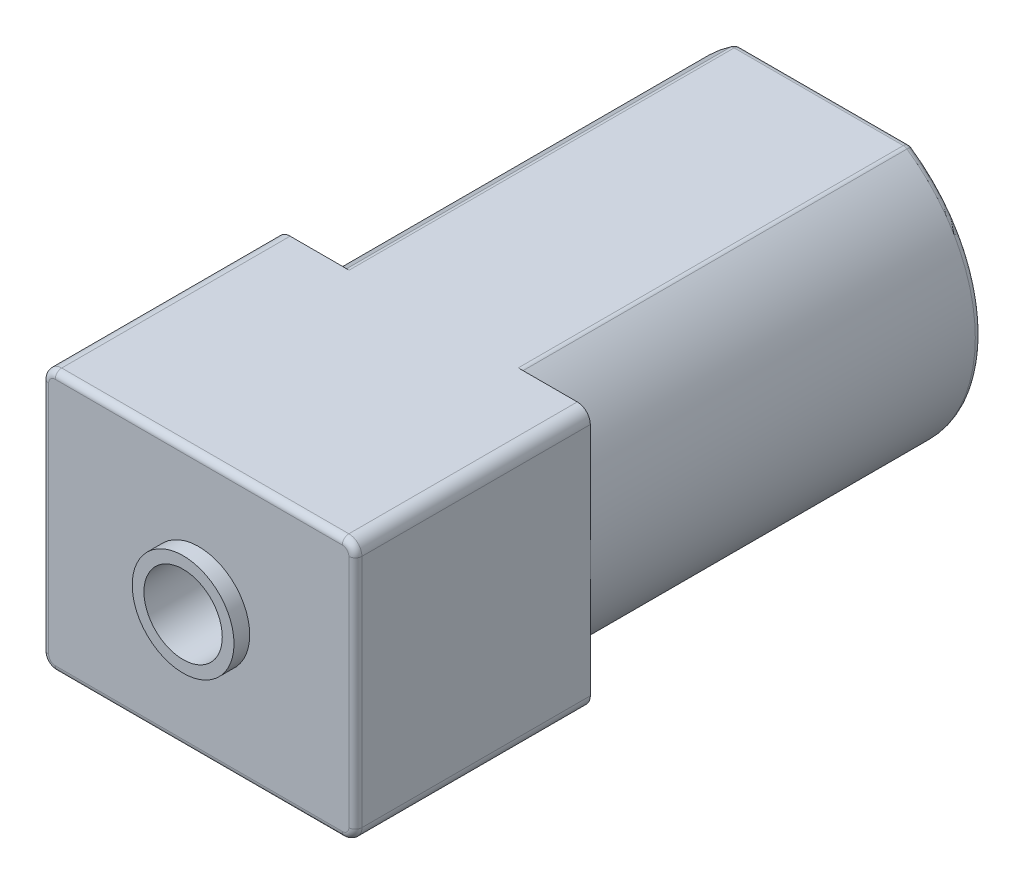
ISO-10303-21;
HEADER;
FILE_DESCRIPTION(('STEP AP214'),'2;1');
FILE_NAME('part.step','',(''),(''),'','','');
FILE_SCHEMA(('AUTOMOTIVE_DESIGN { 1 0 10303 214 1 1 1 1 }'));
ENDSEC;
DATA;
#1=APPLICATION_CONTEXT('core data for automotive mechanical design processes');
#2=APPLICATION_PROTOCOL_DEFINITION('international standard','automotive_design',2000,#1);
#3=PRODUCT_CONTEXT('',#1,'mechanical');
#4=PRODUCT('Part','Part','',(#3));
#5=PRODUCT_RELATED_PRODUCT_CATEGORY('part','',(#4));
#6=PRODUCT_DEFINITION_FORMATION('','',#4);
#7=PRODUCT_DEFINITION_CONTEXT('part definition',#1,'design');
#8=PRODUCT_DEFINITION('design','',#6,#7);
#9=PRODUCT_DEFINITION_SHAPE('','',#8);
#10=(LENGTH_UNIT() NAMED_UNIT(*) SI_UNIT(.MILLI.,.METRE.));
#11=(NAMED_UNIT(*) PLANE_ANGLE_UNIT() SI_UNIT($,.RADIAN.));
#12=(NAMED_UNIT(*) SI_UNIT($,.STERADIAN.) SOLID_ANGLE_UNIT());
#13=UNCERTAINTY_MEASURE_WITH_UNIT(LENGTH_MEASURE(1.E-05),#10,'distance_accuracy_value','');
#14=(GEOMETRIC_REPRESENTATION_CONTEXT(3) GLOBAL_UNCERTAINTY_ASSIGNED_CONTEXT((#13)) GLOBAL_UNIT_ASSIGNED_CONTEXT((#10,
#11,#12)) REPRESENTATION_CONTEXT('',''));
#15=CARTESIAN_POINT('',(0.,0.,0.));
#16=DIRECTION('',(0.,0.,1.));
#17=DIRECTION('',(1.,0.,0.));
#18=AXIS2_PLACEMENT_3D('',#15,#16,#17);
#19=CARTESIAN_POINT('',(-6.,-5.,24.));
#20=DIRECTION('',(0.,0.,1.));
#21=DIRECTION('',(1.,0.,0.));
#22=AXIS2_PLACEMENT_3D('',#19,#20,#21);
#23=PLANE('',#22);
#24=DIRECTION('',(0.,1.,0.));
#25=VECTOR('',#24,1.);
#26=CARTESIAN_POINT('',(5.75,4.5,24.));
#27=LINE('',#26,#25);
#28=CARTESIAN_POINT('',(5.75,-4.5,24.));
#29=VERTEX_POINT('',#28);
#30=CARTESIAN_POINT('',(5.75,4.5,24.));
#31=VERTEX_POINT('',#30);
#32=EDGE_CURVE('E277',#29,#31,#27,.T.);
#33=ORIENTED_EDGE('',*,*,#32,.T.);
#34=CARTESIAN_POINT('',(5.5,4.5,24.));
#35=DIRECTION('',(0.,0.,1.));
#36=DIRECTION('',(1.,0.,0.));
#37=AXIS2_PLACEMENT_3D('',#34,#35,#36);
#38=CIRCLE('',#37,0.25);
#39=CARTESIAN_POINT('',(5.5,4.75,24.));
#40=VERTEX_POINT('',#39);
#41=EDGE_CURVE('E279',#31,#40,#38,.T.);
#42=ORIENTED_EDGE('',*,*,#41,.T.);
#43=DIRECTION('',(-1.,0.,0.));
#44=VECTOR('',#43,1.);
#45=CARTESIAN_POINT('',(-6.,4.75,24.));
#46=LINE('',#45,#44);
#47=CARTESIAN_POINT('',(-5.5,4.75,24.));
#48=VERTEX_POINT('',#47);
#49=EDGE_CURVE('E265',#40,#48,#46,.T.);
#50=ORIENTED_EDGE('',*,*,#49,.T.);
#51=CARTESIAN_POINT('',(-5.5,4.5,24.));
#52=DIRECTION('',(0.,0.,1.));
#53=DIRECTION('',(1.,0.,0.));
#54=AXIS2_PLACEMENT_3D('',#51,#52,#53);
#55=CIRCLE('',#54,0.25);
#56=CARTESIAN_POINT('',(-5.75,4.5,24.));
#57=VERTEX_POINT('',#56);
#58=EDGE_CURVE('E267',#48,#57,#55,.T.);
#59=ORIENTED_EDGE('',*,*,#58,.T.);
#60=DIRECTION('',(0.,-1.,0.));
#61=VECTOR('',#60,1.);
#62=CARTESIAN_POINT('',(-5.75,-4.5,24.));
#63=LINE('',#62,#61);
#64=CARTESIAN_POINT('',(-5.75,-4.5,24.));
#65=VERTEX_POINT('',#64);
#66=EDGE_CURVE('E269',#57,#65,#63,.T.);
#67=ORIENTED_EDGE('',*,*,#66,.T.);
#68=CARTESIAN_POINT('',(-5.5,-4.5,24.));
#69=DIRECTION('',(0.,0.,1.));
#70=DIRECTION('',(1.,0.,0.));
#71=AXIS2_PLACEMENT_3D('',#68,#69,#70);
#72=CIRCLE('',#71,0.25);
#73=CARTESIAN_POINT('',(-5.5,-4.75,24.));
#74=VERTEX_POINT('',#73);
#75=EDGE_CURVE('E271',#65,#74,#72,.T.);
#76=ORIENTED_EDGE('',*,*,#75,.T.);
#77=DIRECTION('',(1.,0.,0.));
#78=VECTOR('',#77,1.);
#79=CARTESIAN_POINT('',(-6.,-4.75,24.));
#80=LINE('',#79,#78);
#81=CARTESIAN_POINT('',(5.5,-4.75,24.));
#82=VERTEX_POINT('',#81);
#83=EDGE_CURVE('E273',#74,#82,#80,.T.);
#84=ORIENTED_EDGE('',*,*,#83,.T.);
#85=CARTESIAN_POINT('',(5.5,-4.5,24.));
#86=DIRECTION('',(0.,0.,1.));
#87=DIRECTION('',(1.,0.,0.));
#88=AXIS2_PLACEMENT_3D('',#85,#86,#87);
#89=CIRCLE('',#88,0.25);
#90=EDGE_CURVE('E275',#82,#29,#89,.T.);
#91=ORIENTED_EDGE('',*,*,#90,.T.);
#92=EDGE_LOOP('',(#33,#42,#50,#59,#67,#76,#84,#91));
#93=FACE_BOUND('',#92,.T.);
#94=CARTESIAN_POINT('',(0.,0.,24.));
#95=DIRECTION('',(0.,0.,1.));
#96=DIRECTION('',(1.,0.,0.));
#97=AXIS2_PLACEMENT_3D('',#94,#95,#96);
#98=CIRCLE('',#97,1.95);
#99=CARTESIAN_POINT('',(1.95,0.,24.));
#100=VERTEX_POINT('',#99);
#101=EDGE_CURVE('E476',#100,#100,#98,.T.);
#102=ORIENTED_EDGE('',*,*,#101,.F.);
#103=EDGE_LOOP('',(#102));
#104=FACE_BOUND('',#103,.T.);
#105=ADVANCED_FACE('F35',(#93,#104),#23,.T.);
#106=CARTESIAN_POINT('',(0.,0.,0.));
#107=DIRECTION('',(0.,0.,1.));
#108=DIRECTION('',(1.,0.,0.));
#109=AXIS2_PLACEMENT_3D('',#106,#107,#108);
#110=PLANE('',#109);
#111=CARTESIAN_POINT('',(0.,0.,0.));
#112=DIRECTION('',(0.,0.,1.));
#113=DIRECTION('',(1.,0.,0.));
#114=AXIS2_PLACEMENT_3D('',#111,#112,#113);
#115=CIRCLE('',#114,2.75);
#116=CARTESIAN_POINT('',(2.75,0.,0.));
#117=VERTEX_POINT('',#116);
#118=EDGE_CURVE('E340',#117,#117,#115,.T.);
#119=ORIENTED_EDGE('',*,*,#118,.T.);
#120=EDGE_LOOP('',(#119));
#121=FACE_BOUND('',#120,.T.);
#122=CARTESIAN_POINT('',(0.,0.,0.));
#123=DIRECTION('',(0.,0.,1.));
#124=DIRECTION('',(1.,0.,0.));
#125=AXIS2_PLACEMENT_3D('',#122,#123,#124);
#126=CIRCLE('',#125,5.75);
#127=CARTESIAN_POINT('',(3.24037034920393,4.75,0.));
#128=VERTEX_POINT('',#127);
#129=CARTESIAN_POINT('',(3.24037034920393,-4.75,0.));
#130=VERTEX_POINT('',#129);
#131=EDGE_CURVE('E335',#128,#130,#126,.F.);
#132=ORIENTED_EDGE('',*,*,#131,.T.);
#133=DIRECTION('',(1.,0.,0.));
#134=VECTOR('',#133,1.);
#135=CARTESIAN_POINT('',(-3.3166247903554,-4.75,0.));
#136=LINE('',#135,#134);
#137=CARTESIAN_POINT('',(-3.24037034920393,-4.75,0.));
#138=VERTEX_POINT('',#137);
#139=EDGE_CURVE('E338',#130,#138,#136,.F.);
#140=ORIENTED_EDGE('',*,*,#139,.T.);
#141=CARTESIAN_POINT('',(0.,0.,0.));
#142=DIRECTION('',(0.,0.,1.));
#143=DIRECTION('',(1.,0.,0.));
#144=AXIS2_PLACEMENT_3D('',#141,#142,#143);
#145=CIRCLE('',#144,5.75);
#146=CARTESIAN_POINT('',(-3.24037034920393,4.75,0.));
#147=VERTEX_POINT('',#146);
#148=EDGE_CURVE('E333',#138,#147,#145,.F.);
#149=ORIENTED_EDGE('',*,*,#148,.T.);
#150=DIRECTION('',(-1.,0.,0.));
#151=VECTOR('',#150,1.);
#152=CARTESIAN_POINT('',(3.3166247903554,4.75,0.));
#153=LINE('',#152,#151);
#154=EDGE_CURVE('E331',#147,#128,#153,.F.);
#155=ORIENTED_EDGE('',*,*,#154,.T.);
#156=EDGE_LOOP('',(#132,#140,#149,#155));
#157=FACE_BOUND('',#156,.T.);
#158=ADVANCED_FACE('F440',(#121,#157),#110,.F.);
#159=CARTESIAN_POINT('',(0.,0.,15.));
#160=DIRECTION('',(0.,0.,-1.));
#161=DIRECTION('',(-1.,0.,0.));
#162=AXIS2_PLACEMENT_3D('',#159,#160,#161);
#163=CYLINDRICAL_SURFACE('',#162,6.);
#164=CARTESIAN_POINT('',(0.,0.,0.25));
#165=DIRECTION('',(0.,0.,1.));
#166=DIRECTION('',(1.,0.,0.));
#167=AXIS2_PLACEMENT_3D('',#164,#165,#166);
#168=CIRCLE('',#167,6.);
#169=CARTESIAN_POINT('',(-3.38125601656063,4.95652173913043,0.25));
#170=VERTEX_POINT('',#169);
#171=CARTESIAN_POINT('',(-3.38125601656062,-4.95652173913043,0.25));
#172=VERTEX_POINT('',#171);
#173=EDGE_CURVE('E360',#170,#172,#168,.T.);
#174=ORIENTED_EDGE('',*,*,#173,.T.);
#175=DIRECTION('',(0.,0.,-1.));
#176=VECTOR('',#175,1.);
#177=CARTESIAN_POINT('',(-3.38125601656062,-4.95652173913044,15.));
#178=LINE('',#177,#176);
#179=CARTESIAN_POINT('',(-3.38125601656062,-4.95652173913043,15.));
#180=VERTEX_POINT('',#179);
#181=EDGE_CURVE('E364',#172,#180,#178,.F.);
#182=ORIENTED_EDGE('',*,*,#181,.T.);
#183=CARTESIAN_POINT('',(0.,0.,15.));
#184=DIRECTION('',(0.,0.,1.));
#185=DIRECTION('',(1.,0.,0.));
#186=AXIS2_PLACEMENT_3D('',#183,#184,#185);
#187=CIRCLE('',#186,6.);
#188=CARTESIAN_POINT('',(-6.,0.,15.));
#189=VERTEX_POINT('',#188);
#190=EDGE_CURVE('E238',#189,#180,#187,.T.);
#191=ORIENTED_EDGE('',*,*,#190,.F.);
#192=CARTESIAN_POINT('',(-3.38125601656063,4.95652173913043,15.));
#193=VERTEX_POINT('',#192);
#194=EDGE_CURVE('E220',#193,#189,#187,.T.);
#195=ORIENTED_EDGE('',*,*,#194,.F.);
#196=DIRECTION('',(0.,0.,-1.));
#197=VECTOR('',#196,1.);
#198=CARTESIAN_POINT('',(-3.38125601656063,4.95652173913043,15.));
#199=LINE('',#198,#197);
#200=EDGE_CURVE('E362',#193,#170,#199,.T.);
#201=ORIENTED_EDGE('',*,*,#200,.T.);
#202=EDGE_LOOP('',(#174,#182,#191,#195,#201));
#203=FACE_BOUND('',#202,.T.);
#204=ADVANCED_FACE('F447',(#203),#163,.T.);
#205=CARTESIAN_POINT('',(3.38125601656063,-4.95652173913043,15.));
#206=VERTEX_POINT('',#205);
#207=CARTESIAN_POINT('',(6.,0.,15.));
#208=VERTEX_POINT('',#207);
#209=EDGE_CURVE('E191',#206,#208,#187,.T.);
#210=ORIENTED_EDGE('',*,*,#209,.F.);
#211=DIRECTION('',(0.,0.,-1.));
#212=VECTOR('',#211,1.);
#213=CARTESIAN_POINT('',(3.38125601656063,-4.95652173913043,15.));
#214=LINE('',#213,#212);
#215=CARTESIAN_POINT('',(3.38125601656063,-4.95652173913043,0.25));
#216=VERTEX_POINT('',#215);
#217=EDGE_CURVE('E359',#206,#216,#214,.T.);
#218=ORIENTED_EDGE('',*,*,#217,.T.);
#219=CARTESIAN_POINT('',(0.,0.,0.25));
#220=DIRECTION('',(0.,0.,1.));
#221=DIRECTION('',(1.,0.,0.));
#222=AXIS2_PLACEMENT_3D('',#219,#220,#221);
#223=CIRCLE('',#222,6.);
#224=CARTESIAN_POINT('',(3.38125601656063,4.95652173913043,0.25));
#225=VERTEX_POINT('',#224);
#226=EDGE_CURVE('E349',#216,#225,#223,.T.);
#227=ORIENTED_EDGE('',*,*,#226,.T.);
#228=DIRECTION('',(0.,0.,-1.));
#229=VECTOR('',#228,1.);
#230=CARTESIAN_POINT('',(3.38125601656063,4.95652173913043,15.));
#231=LINE('',#230,#229);
#232=CARTESIAN_POINT('',(3.38125601656063,4.95652173913043,15.));
#233=VERTEX_POINT('',#232);
#234=EDGE_CURVE('E217',#225,#233,#231,.F.);
#235=ORIENTED_EDGE('',*,*,#234,.T.);
#236=EDGE_CURVE('E201',#208,#233,#187,.T.);
#237=ORIENTED_EDGE('',*,*,#236,.F.);
#238=EDGE_LOOP('',(#210,#218,#227,#235,#237));
#239=FACE_BOUND('',#238,.T.);
#240=ADVANCED_FACE('F215',(#239),#163,.T.);
#241=CARTESIAN_POINT('',(-6.,-5.,0.));
#242=DIRECTION('',(0.,-1.,0.));
#243=DIRECTION('',(1.,0.,0.));
#244=AXIS2_PLACEMENT_3D('',#241,#242,#243);
#245=PLANE('',#244);
#246=DIRECTION('',(0.,0.,1.));
#247=VECTOR('',#246,1.);
#248=CARTESIAN_POINT('',(3.24037034920393,-5.,15.));
#249=LINE('',#248,#247);
#250=CARTESIAN_POINT('',(3.24037034920393,-5.,0.25));
#251=VERTEX_POINT('',#250);
#252=CARTESIAN_POINT('',(3.24037034920393,-5.,15.));
#253=VERTEX_POINT('',#252);
#254=EDGE_CURVE('E347',#251,#253,#249,.T.);
#255=ORIENTED_EDGE('',*,*,#254,.T.);
#256=DIRECTION('',(1.,0.,0.));
#257=VECTOR('',#256,1.);
#258=CARTESIAN_POINT('',(-6.,-5.,15.));
#259=LINE('',#258,#257);
#260=CARTESIAN_POINT('',(5.5,-5.,15.));
#261=VERTEX_POINT('',#260);
#262=EDGE_CURVE('E226',#253,#261,#259,.T.);
#263=ORIENTED_EDGE('',*,*,#262,.T.);
#264=DIRECTION('',(0.,0.,-1.));
#265=VECTOR('',#264,1.);
#266=CARTESIAN_POINT('',(5.5,-5.,24.));
#267=LINE('',#266,#265);
#268=CARTESIAN_POINT('',(5.5,-5.,23.75));
#269=VERTEX_POINT('',#268);
#270=EDGE_CURVE('E255',#261,#269,#267,.F.);
#271=ORIENTED_EDGE('',*,*,#270,.T.);
#272=DIRECTION('',(1.,0.,0.));
#273=VECTOR('',#272,1.);
#274=CARTESIAN_POINT('',(-6.,-5.,23.75));
#275=LINE('',#274,#273);
#276=CARTESIAN_POINT('',(-5.5,-5.,23.75));
#277=VERTEX_POINT('',#276);
#278=EDGE_CURVE('E289',#269,#277,#275,.F.);
#279=ORIENTED_EDGE('',*,*,#278,.T.);
#280=DIRECTION('',(0.,0.,-1.));
#281=VECTOR('',#280,1.);
#282=CARTESIAN_POINT('',(-5.5,-5.,15.));
#283=LINE('',#282,#281);
#284=CARTESIAN_POINT('',(-5.5,-5.,15.));
#285=VERTEX_POINT('',#284);
#286=EDGE_CURVE('E259',#277,#285,#283,.T.);
#287=ORIENTED_EDGE('',*,*,#286,.T.);
#288=CARTESIAN_POINT('',(-3.24037034920393,-5.,15.));
#289=VERTEX_POINT('',#288);
#290=EDGE_CURVE('E225',#285,#289,#259,.T.);
#291=ORIENTED_EDGE('',*,*,#290,.T.);
#292=DIRECTION('',(0.,0.,1.));
#293=VECTOR('',#292,1.);
#294=CARTESIAN_POINT('',(-3.24037034920393,-5.,0.));
#295=LINE('',#294,#293);
#296=CARTESIAN_POINT('',(-3.24037034920393,-5.,0.25));
#297=VERTEX_POINT('',#296);
#298=EDGE_CURVE('E345',#289,#297,#295,.F.);
#299=ORIENTED_EDGE('',*,*,#298,.T.);
#300=DIRECTION('',(1.,0.,0.));
#301=VECTOR('',#300,1.);
#302=CARTESIAN_POINT('',(3.3166247903554,-5.,0.25));
#303=LINE('',#302,#301);
#304=EDGE_CURVE('E343',#297,#251,#303,.T.);
#305=ORIENTED_EDGE('',*,*,#304,.T.);
#306=EDGE_LOOP('',(#255,#263,#271,#279,#287,#291,#299,#305));
#307=FACE_BOUND('',#306,.T.);
#308=ADVANCED_FACE('F524',(#307),#245,.T.);
#309=CARTESIAN_POINT('',(-6.,5.,0.));
#310=DIRECTION('',(0.,1.,0.));
#311=DIRECTION('',(-1.,0.,0.));
#312=AXIS2_PLACEMENT_3D('',#309,#310,#311);
#313=PLANE('',#312);
#314=DIRECTION('',(0.,0.,1.));
#315=VECTOR('',#314,1.);
#316=CARTESIAN_POINT('',(-3.24037034920393,5.,15.));
#317=LINE('',#316,#315);
#318=CARTESIAN_POINT('',(-3.24037034920393,5.,0.25));
#319=VERTEX_POINT('',#318);
#320=CARTESIAN_POINT('',(-3.24037034920393,5.,15.));
#321=VERTEX_POINT('',#320);
#322=EDGE_CURVE('E370',#319,#321,#317,.T.);
#323=ORIENTED_EDGE('',*,*,#322,.T.);
#324=DIRECTION('',(-1.,0.,0.));
#325=VECTOR('',#324,1.);
#326=CARTESIAN_POINT('',(-6.,5.,15.));
#327=LINE('',#326,#325);
#328=CARTESIAN_POINT('',(-5.5,5.,15.));
#329=VERTEX_POINT('',#328);
#330=EDGE_CURVE('E52',#321,#329,#327,.T.);
#331=ORIENTED_EDGE('',*,*,#330,.T.);
#332=DIRECTION('',(0.,0.,-1.));
#333=VECTOR('',#332,1.);
#334=CARTESIAN_POINT('',(-5.5,5.,24.));
#335=LINE('',#334,#333);
#336=CARTESIAN_POINT('',(-5.5,5.,23.75));
#337=VERTEX_POINT('',#336);
#338=EDGE_CURVE('E200',#329,#337,#335,.F.);
#339=ORIENTED_EDGE('',*,*,#338,.T.);
#340=DIRECTION('',(-1.,0.,0.));
#341=VECTOR('',#340,1.);
#342=CARTESIAN_POINT('',(-6.,5.,23.75));
#343=LINE('',#342,#341);
#344=CARTESIAN_POINT('',(5.5,5.,23.75));
#345=VERTEX_POINT('',#344);
#346=EDGE_CURVE('E297',#337,#345,#343,.F.);
#347=ORIENTED_EDGE('',*,*,#346,.T.);
#348=DIRECTION('',(0.,0.,-1.));
#349=VECTOR('',#348,1.);
#350=CARTESIAN_POINT('',(5.5,5.,15.));
#351=LINE('',#350,#349);
#352=CARTESIAN_POINT('',(5.5,5.,15.));
#353=VERTEX_POINT('',#352);
#354=EDGE_CURVE('E243',#345,#353,#351,.T.);
#355=ORIENTED_EDGE('',*,*,#354,.T.);
#356=CARTESIAN_POINT('',(3.24037034920393,5.,15.));
#357=VERTEX_POINT('',#356);
#358=EDGE_CURVE('E60',#353,#357,#327,.T.);
#359=ORIENTED_EDGE('',*,*,#358,.T.);
#360=DIRECTION('',(0.,0.,1.));
#361=VECTOR('',#360,1.);
#362=CARTESIAN_POINT('',(3.24037034920393,5.,0.));
#363=LINE('',#362,#361);
#364=CARTESIAN_POINT('',(3.24037034920393,5.,0.25));
#365=VERTEX_POINT('',#364);
#366=EDGE_CURVE('E368',#357,#365,#363,.F.);
#367=ORIENTED_EDGE('',*,*,#366,.T.);
#368=DIRECTION('',(-1.,0.,0.));
#369=VECTOR('',#368,1.);
#370=CARTESIAN_POINT('',(-3.3166247903554,5.,0.25));
#371=LINE('',#370,#369);
#372=EDGE_CURVE('E366',#365,#319,#371,.T.);
#373=ORIENTED_EDGE('',*,*,#372,.T.);
#374=EDGE_LOOP('',(#323,#331,#339,#347,#355,#359,#367,#373));
#375=FACE_BOUND('',#374,.T.);
#376=ADVANCED_FACE('F422',(#375),#313,.T.);
#377=CARTESIAN_POINT('',(-6.,-5.,15.));
#378=DIRECTION('',(0.,0.,1.));
#379=DIRECTION('',(1.,0.,0.));
#380=AXIS2_PLACEMENT_3D('',#377,#378,#379);
#381=PLANE('',#380);
#382=DIRECTION('',(0.,1.,0.));
#383=VECTOR('',#382,1.);
#384=CARTESIAN_POINT('',(6.,5.,15.));
#385=LINE('',#384,#383);
#386=CARTESIAN_POINT('',(6.,-4.5,15.));
#387=VERTEX_POINT('',#386);
#388=EDGE_CURVE('E194',#387,#208,#385,.T.);
#389=ORIENTED_EDGE('',*,*,#388,.F.);
#390=CARTESIAN_POINT('',(5.5,-4.5,15.));
#391=DIRECTION('',(0.,0.,1.));
#392=DIRECTION('',(1.,0.,0.));
#393=AXIS2_PLACEMENT_3D('',#390,#391,#392);
#394=CIRCLE('',#393,0.5);
#395=EDGE_CURVE('E263',#387,#261,#394,.F.);
#396=ORIENTED_EDGE('',*,*,#395,.T.);
#397=ORIENTED_EDGE('',*,*,#262,.F.);
#398=CARTESIAN_POINT('',(3.24037034920393,-4.75,15.));
#399=DIRECTION('',(0.,0.,1.));
#400=DIRECTION('',(1.,0.,0.));
#401=AXIS2_PLACEMENT_3D('',#398,#399,#400);
#402=CIRCLE('',#401,0.25);
#403=EDGE_CURVE('E196',#253,#206,#402,.T.);
#404=ORIENTED_EDGE('',*,*,#403,.T.);
#405=ORIENTED_EDGE('',*,*,#209,.T.);
#406=EDGE_LOOP('',(#389,#396,#397,#404,#405));
#407=FACE_BOUND('',#406,.T.);
#408=ADVANCED_FACE('F193',(#407),#381,.F.);
#409=ORIENTED_EDGE('',*,*,#358,.F.);
#410=CARTESIAN_POINT('',(5.5,4.5,15.));
#411=DIRECTION('',(0.,0.,1.));
#412=DIRECTION('',(1.,0.,0.));
#413=AXIS2_PLACEMENT_3D('',#410,#411,#412);
#414=CIRCLE('',#413,0.5);
#415=CARTESIAN_POINT('',(6.,4.5,15.));
#416=VERTEX_POINT('',#415);
#417=EDGE_CURVE('E224',#353,#416,#414,.F.);
#418=ORIENTED_EDGE('',*,*,#417,.T.);
#419=EDGE_CURVE('E208',#208,#416,#385,.T.);
#420=ORIENTED_EDGE('',*,*,#419,.F.);
#421=ORIENTED_EDGE('',*,*,#236,.T.);
#422=CARTESIAN_POINT('',(3.24037034920393,4.75,15.));
#423=DIRECTION('',(0.,0.,1.));
#424=DIRECTION('',(1.,0.,0.));
#425=AXIS2_PLACEMENT_3D('',#422,#423,#424);
#426=CIRCLE('',#425,0.25);
#427=EDGE_CURVE('E13',#233,#357,#426,.T.);
#428=ORIENTED_EDGE('',*,*,#427,.T.);
#429=EDGE_LOOP('',(#409,#418,#420,#421,#428));
#430=FACE_BOUND('',#429,.T.);
#431=ADVANCED_FACE('F222',(#430),#381,.F.);
#432=DIRECTION('',(0.,-1.,0.));
#433=VECTOR('',#432,1.);
#434=CARTESIAN_POINT('',(-6.,5.,15.));
#435=LINE('',#434,#433);
#436=CARTESIAN_POINT('',(-6.,4.5,15.));
#437=VERTEX_POINT('',#436);
#438=EDGE_CURVE('E466',#437,#189,#435,.T.);
#439=ORIENTED_EDGE('',*,*,#438,.F.);
#440=CARTESIAN_POINT('',(-5.5,4.5,15.));
#441=DIRECTION('',(0.,0.,1.));
#442=DIRECTION('',(1.,0.,0.));
#443=AXIS2_PLACEMENT_3D('',#440,#441,#442);
#444=CIRCLE('',#443,0.5);
#445=EDGE_CURVE('E254',#437,#329,#444,.F.);
#446=ORIENTED_EDGE('',*,*,#445,.T.);
#447=ORIENTED_EDGE('',*,*,#330,.F.);
#448=CARTESIAN_POINT('',(-3.24037034920393,4.75,15.));
#449=DIRECTION('',(0.,0.,1.));
#450=DIRECTION('',(1.,0.,0.));
#451=AXIS2_PLACEMENT_3D('',#448,#449,#450);
#452=CIRCLE('',#451,0.25);
#453=EDGE_CURVE('E44',#321,#193,#452,.T.);
#454=ORIENTED_EDGE('',*,*,#453,.T.);
#455=ORIENTED_EDGE('',*,*,#194,.T.);
#456=EDGE_LOOP('',(#439,#446,#447,#454,#455));
#457=FACE_BOUND('',#456,.T.);
#458=ADVANCED_FACE('F465',(#457),#381,.F.);
#459=ORIENTED_EDGE('',*,*,#290,.F.);
#460=CARTESIAN_POINT('',(-5.5,-4.5,15.));
#461=DIRECTION('',(0.,0.,1.));
#462=DIRECTION('',(1.,0.,0.));
#463=AXIS2_PLACEMENT_3D('',#460,#461,#462);
#464=CIRCLE('',#463,0.5);
#465=CARTESIAN_POINT('',(-6.,-4.5,15.));
#466=VERTEX_POINT('',#465);
#467=EDGE_CURVE('E261',#285,#466,#464,.F.);
#468=ORIENTED_EDGE('',*,*,#467,.T.);
#469=EDGE_CURVE('E462',#189,#466,#435,.T.);
#470=ORIENTED_EDGE('',*,*,#469,.F.);
#471=ORIENTED_EDGE('',*,*,#190,.T.);
#472=CARTESIAN_POINT('',(-3.24037034920393,-4.75,15.));
#473=DIRECTION('',(0.,0.,1.));
#474=DIRECTION('',(1.,0.,0.));
#475=AXIS2_PLACEMENT_3D('',#472,#473,#474);
#476=CIRCLE('',#475,0.25);
#477=EDGE_CURVE('E373',#180,#289,#476,.T.);
#478=ORIENTED_EDGE('',*,*,#477,.T.);
#479=EDGE_LOOP('',(#459,#468,#470,#471,#478));
#480=FACE_BOUND('',#479,.T.);
#481=ADVANCED_FACE('F459',(#480),#381,.F.);
#482=CARTESIAN_POINT('',(-6.,5.,24.));
#483=DIRECTION('',(1.,0.,0.));
#484=DIRECTION('',(0.,0.,-1.));
#485=AXIS2_PLACEMENT_3D('',#482,#483,#484);
#486=PLANE('',#485);
#487=DIRECTION('',(0.,0.,-1.));
#488=VECTOR('',#487,1.);
#489=CARTESIAN_POINT('',(-6.,-4.5,24.));
#490=LINE('',#489,#488);
#491=CARTESIAN_POINT('',(-6.,-4.5,23.75));
#492=VERTEX_POINT('',#491);
#493=EDGE_CURVE('E249',#466,#492,#490,.F.);
#494=ORIENTED_EDGE('',*,*,#493,.T.);
#495=DIRECTION('',(0.,-1.,0.));
#496=VECTOR('',#495,1.);
#497=CARTESIAN_POINT('',(-6.,4.5,23.75));
#498=LINE('',#497,#496);
#499=CARTESIAN_POINT('',(-6.,4.5,23.75));
#500=VERTEX_POINT('',#499);
#501=EDGE_CURVE('E293',#492,#500,#498,.F.);
#502=ORIENTED_EDGE('',*,*,#501,.T.);
#503=DIRECTION('',(0.,0.,-1.));
#504=VECTOR('',#503,1.);
#505=CARTESIAN_POINT('',(-6.,4.5,15.));
#506=LINE('',#505,#504);
#507=EDGE_CURVE('E252',#500,#437,#506,.T.);
#508=ORIENTED_EDGE('',*,*,#507,.T.);
#509=ORIENTED_EDGE('',*,*,#438,.T.);
#510=ORIENTED_EDGE('',*,*,#469,.T.);
#511=EDGE_LOOP('',(#494,#502,#508,#509,#510));
#512=FACE_BOUND('',#511,.T.);
#513=ADVANCED_FACE('F468',(#512),#486,.F.);
#514=CARTESIAN_POINT('',(6.,5.,24.));
#515=DIRECTION('',(-1.,0.,0.));
#516=DIRECTION('',(0.,0.,1.));
#517=AXIS2_PLACEMENT_3D('',#514,#515,#516);
#518=PLANE('',#517);
#519=DIRECTION('',(0.,0.,-1.));
#520=VECTOR('',#519,1.);
#521=CARTESIAN_POINT('',(6.,4.5,24.));
#522=LINE('',#521,#520);
#523=CARTESIAN_POINT('',(6.,4.5,23.75));
#524=VERTEX_POINT('',#523);
#525=EDGE_CURVE('E247',#416,#524,#522,.F.);
#526=ORIENTED_EDGE('',*,*,#525,.T.);
#527=DIRECTION('',(0.,1.,0.));
#528=VECTOR('',#527,1.);
#529=CARTESIAN_POINT('',(6.,-4.5,23.75));
#530=LINE('',#529,#528);
#531=CARTESIAN_POINT('',(6.,-4.5,23.75));
#532=VERTEX_POINT('',#531);
#533=EDGE_CURVE('E285',#524,#532,#530,.F.);
#534=ORIENTED_EDGE('',*,*,#533,.T.);
#535=DIRECTION('',(0.,0.,-1.));
#536=VECTOR('',#535,1.);
#537=CARTESIAN_POINT('',(6.,-4.5,15.));
#538=LINE('',#537,#536);
#539=EDGE_CURVE('E211',#532,#387,#538,.T.);
#540=ORIENTED_EDGE('',*,*,#539,.T.);
#541=ORIENTED_EDGE('',*,*,#388,.T.);
#542=ORIENTED_EDGE('',*,*,#419,.T.);
#543=EDGE_LOOP('',(#526,#534,#540,#541,#542));
#544=FACE_BOUND('',#543,.T.);
#545=ADVANCED_FACE('F206',(#544),#518,.F.);
#546=CARTESIAN_POINT('',(5.5,4.5,0.));
#547=DIRECTION('',(0.,0.,1.));
#548=DIRECTION('',(1.,0.,0.));
#549=AXIS2_PLACEMENT_3D('',#546,#547,#548);
#550=CYLINDRICAL_SURFACE('',#549,0.5);
#551=ORIENTED_EDGE('',*,*,#354,.F.);
#552=CARTESIAN_POINT('',(5.5,4.5,23.75));
#553=DIRECTION('',(0.,0.,1.));
#554=DIRECTION('',(1.,0.,0.));
#555=AXIS2_PLACEMENT_3D('',#552,#553,#554);
#556=CIRCLE('',#555,0.5);
#557=EDGE_CURVE('E282',#345,#524,#556,.F.);
#558=ORIENTED_EDGE('',*,*,#557,.T.);
#559=ORIENTED_EDGE('',*,*,#525,.F.);
#560=ORIENTED_EDGE('',*,*,#417,.F.);
#561=EDGE_LOOP('',(#551,#558,#559,#560));
#562=FACE_BOUND('',#561,.T.);
#563=ADVANCED_FACE('F519',(#562),#550,.T.);
#564=CARTESIAN_POINT('',(-5.5,4.5,24.));
#565=DIRECTION('',(0.,0.,1.));
#566=DIRECTION('',(1.,0.,0.));
#567=AXIS2_PLACEMENT_3D('',#564,#565,#566);
#568=CYLINDRICAL_SURFACE('',#567,0.5);
#569=ORIENTED_EDGE('',*,*,#507,.F.);
#570=CARTESIAN_POINT('',(-5.5,4.5,23.75));
#571=DIRECTION('',(0.,0.,1.));
#572=DIRECTION('',(1.,0.,0.));
#573=AXIS2_PLACEMENT_3D('',#570,#571,#572);
#574=CIRCLE('',#573,0.5);
#575=EDGE_CURVE('E295',#500,#337,#574,.F.);
#576=ORIENTED_EDGE('',*,*,#575,.T.);
#577=ORIENTED_EDGE('',*,*,#338,.F.);
#578=ORIENTED_EDGE('',*,*,#445,.F.);
#579=EDGE_LOOP('',(#569,#576,#577,#578));
#580=FACE_BOUND('',#579,.T.);
#581=ADVANCED_FACE('F532',(#580),#568,.T.);
#582=CARTESIAN_POINT('',(-5.5,-4.5,0.));
#583=DIRECTION('',(0.,0.,1.));
#584=DIRECTION('',(1.,0.,0.));
#585=AXIS2_PLACEMENT_3D('',#582,#583,#584);
#586=CYLINDRICAL_SURFACE('',#585,0.5);
#587=ORIENTED_EDGE('',*,*,#286,.F.);
#588=CARTESIAN_POINT('',(-5.5,-4.5,23.75));
#589=DIRECTION('',(0.,0.,1.));
#590=DIRECTION('',(1.,0.,0.));
#591=AXIS2_PLACEMENT_3D('',#588,#589,#590);
#592=CIRCLE('',#591,0.5);
#593=EDGE_CURVE('E291',#277,#492,#592,.F.);
#594=ORIENTED_EDGE('',*,*,#593,.T.);
#595=ORIENTED_EDGE('',*,*,#493,.F.);
#596=ORIENTED_EDGE('',*,*,#467,.F.);
#597=EDGE_LOOP('',(#587,#594,#595,#596));
#598=FACE_BOUND('',#597,.T.);
#599=ADVANCED_FACE('F536',(#598),#586,.T.);
#600=CARTESIAN_POINT('',(5.5,-4.5,24.));
#601=DIRECTION('',(0.,0.,1.));
#602=DIRECTION('',(1.,0.,0.));
#603=AXIS2_PLACEMENT_3D('',#600,#601,#602);
#604=CYLINDRICAL_SURFACE('',#603,0.5);
#605=ORIENTED_EDGE('',*,*,#539,.F.);
#606=CARTESIAN_POINT('',(5.5,-4.5,23.75));
#607=DIRECTION('',(0.,0.,1.));
#608=DIRECTION('',(1.,0.,0.));
#609=AXIS2_PLACEMENT_3D('',#606,#607,#608);
#610=CIRCLE('',#609,0.5);
#611=EDGE_CURVE('E287',#532,#269,#610,.F.);
#612=ORIENTED_EDGE('',*,*,#611,.T.);
#613=ORIENTED_EDGE('',*,*,#270,.F.);
#614=ORIENTED_EDGE('',*,*,#395,.F.);
#615=EDGE_LOOP('',(#605,#612,#613,#614));
#616=FACE_BOUND('',#615,.T.);
#617=ADVANCED_FACE('F540',(#616),#604,.T.);
#618=CARTESIAN_POINT('',(0.,0.,-2.));
#619=DIRECTION('',(0.,0.,1.));
#620=DIRECTION('',(1.,0.,0.));
#621=AXIS2_PLACEMENT_3D('',#618,#619,#620);
#622=CYLINDRICAL_SURFACE('',#621,2.5);
#623=CARTESIAN_POINT('',(0.,0.,-1.75));
#624=DIRECTION('',(0.,0.,-1.));
#625=DIRECTION('',(-1.,0.,0.));
#626=AXIS2_PLACEMENT_3D('',#623,#624,#625);
#627=CIRCLE('',#626,2.5);
#628=CARTESIAN_POINT('',(-2.5,0.,-1.75));
#629=VERTEX_POINT('',#628);
#630=EDGE_CURVE('E328',#629,#629,#627,.F.);
#631=ORIENTED_EDGE('',*,*,#630,.T.);
#632=EDGE_LOOP('',(#631));
#633=FACE_BOUND('',#632,.T.);
#634=CARTESIAN_POINT('',(0.,0.,-0.25));
#635=DIRECTION('',(0.,0.,1.));
#636=DIRECTION('',(1.,0.,0.));
#637=AXIS2_PLACEMENT_3D('',#634,#635,#636);
#638=CIRCLE('',#637,2.5);
#639=CARTESIAN_POINT('',(2.5,0.,-0.25));
#640=VERTEX_POINT('',#639);
#641=EDGE_CURVE('E325',#640,#640,#638,.F.);
#642=ORIENTED_EDGE('',*,*,#641,.T.);
#643=EDGE_LOOP('',(#642));
#644=FACE_BOUND('',#643,.T.);
#645=ADVANCED_FACE('F513',(#633,#644),#622,.T.);
#646=CARTESIAN_POINT('',(0.,0.,-2.));
#647=DIRECTION('',(0.,0.,-1.));
#648=DIRECTION('',(-1.,0.,0.));
#649=AXIS2_PLACEMENT_3D('',#646,#647,#648);
#650=PLANE('',#649);
#651=CARTESIAN_POINT('',(0.,0.,-2.));
#652=DIRECTION('',(0.,0.,-1.));
#653=DIRECTION('',(-1.,0.,0.));
#654=AXIS2_PLACEMENT_3D('',#651,#652,#653);
#655=CIRCLE('',#654,2.25);
#656=CARTESIAN_POINT('',(-2.25,0.,-2.));
#657=VERTEX_POINT('',#656);
#658=EDGE_CURVE('E299',#657,#657,#655,.T.);
#659=ORIENTED_EDGE('',*,*,#658,.T.);
#660=EDGE_LOOP('',(#659));
#661=FACE_BOUND('',#660,.T.);
#662=CARTESIAN_POINT('',(0.,0.,-2.));
#663=DIRECTION('',(0.,0.,-1.));
#664=DIRECTION('',(-1.,0.,0.));
#665=AXIS2_PLACEMENT_3D('',#662,#663,#664);
#666=CIRCLE('',#665,1.5);
#667=CARTESIAN_POINT('',(-1.5,0.,-2.));
#668=VERTEX_POINT('',#667);
#669=EDGE_CURVE('E322',#668,#668,#666,.T.);
#670=ORIENTED_EDGE('',*,*,#669,.F.);
#671=EDGE_LOOP('',(#670));
#672=FACE_BOUND('',#671,.T.);
#673=ADVANCED_FACE('F662',(#661,#672),#650,.T.);
#674=CARTESIAN_POINT('',(0.,0.,24.));
#675=DIRECTION('',(0.,0.,-1.));
#676=DIRECTION('',(-1.,0.,0.));
#677=AXIS2_PLACEMENT_3D('',#674,#675,#676);
#678=CYLINDRICAL_SURFACE('',#677,1.5);
#679=ORIENTED_EDGE('',*,*,#669,.T.);
#680=EDGE_LOOP('',(#679));
#681=FACE_BOUND('',#680,.T.);
#682=CARTESIAN_POINT('',(0.,0.,24.6));
#683=DIRECTION('',(0.,0.,1.));
#684=DIRECTION('',(1.,0.,0.));
#685=AXIS2_PLACEMENT_3D('',#682,#683,#684);
#686=CIRCLE('',#685,1.5);
#687=CARTESIAN_POINT('',(1.5,0.,24.6));
#688=VERTEX_POINT('',#687);
#689=EDGE_CURVE('E479',#688,#688,#686,.T.);
#690=ORIENTED_EDGE('',*,*,#689,.T.);
#691=EDGE_LOOP('',(#690));
#692=FACE_BOUND('',#691,.T.);
#693=ADVANCED_FACE('F485',(#681,#692),#678,.F.);
#694=CARTESIAN_POINT('',(-5.5,-4.5,23.75));
#695=DIRECTION('',(0.,0.,1.));
#696=DIRECTION('',(1.,0.,0.));
#697=AXIS2_PLACEMENT_3D('',#694,#695,#696);
#698=DEGENERATE_TOROIDAL_SURFACE('',#697,0.25,0.25,.T.);
#699=CARTESIAN_POINT('',(-5.75,-4.5,23.75));
#700=DIRECTION('',(0.,1.,0.));
#701=DIRECTION('',(0.,0.,1.));
#702=AXIS2_PLACEMENT_3D('',#699,#700,#701);
#703=CIRCLE('',#702,0.25);
#704=EDGE_CURVE('E316',#492,#65,#703,.T.);
#705=ORIENTED_EDGE('',*,*,#704,.F.);
#706=ORIENTED_EDGE('',*,*,#593,.F.);
#707=CARTESIAN_POINT('',(-5.5,-4.75,23.75));
#708=DIRECTION('',(1.,0.,0.));
#709=DIRECTION('',(0.,0.,-1.));
#710=AXIS2_PLACEMENT_3D('',#707,#708,#709);
#711=CIRCLE('',#710,0.25);
#712=EDGE_CURVE('E319',#74,#277,#711,.T.);
#713=ORIENTED_EDGE('',*,*,#712,.F.);
#714=ORIENTED_EDGE('',*,*,#75,.F.);
#715=EDGE_LOOP('',(#705,#706,#713,#714));
#716=FACE_BOUND('',#715,.T.);
#717=ADVANCED_FACE('F573',(#716),#698,.T.);
#718=CARTESIAN_POINT('',(-6.,-4.75,23.75));
#719=DIRECTION('',(1.,0.,0.));
#720=DIRECTION('',(0.,1.,0.));
#721=AXIS2_PLACEMENT_3D('',#718,#719,#720);
#722=CYLINDRICAL_SURFACE('',#721,0.25);
#723=ORIENTED_EDGE('',*,*,#712,.T.);
#724=ORIENTED_EDGE('',*,*,#278,.F.);
#725=CARTESIAN_POINT('',(5.5,-4.75,23.75));
#726=DIRECTION('',(1.,0.,0.));
#727=DIRECTION('',(0.,0.,-1.));
#728=AXIS2_PLACEMENT_3D('',#725,#726,#727);
#729=CIRCLE('',#728,0.25);
#730=EDGE_CURVE('E313',#82,#269,#729,.T.);
#731=ORIENTED_EDGE('',*,*,#730,.F.);
#732=ORIENTED_EDGE('',*,*,#83,.F.);
#733=EDGE_LOOP('',(#723,#724,#731,#732));
#734=FACE_BOUND('',#733,.T.);
#735=ADVANCED_FACE('F569',(#734),#722,.T.);
#736=CARTESIAN_POINT('',(-5.75,-5.,23.75));
#737=DIRECTION('',(0.,1.,0.));
#738=DIRECTION('',(0.,0.,1.));
#739=AXIS2_PLACEMENT_3D('',#736,#737,#738);
#740=CYLINDRICAL_SURFACE('',#739,0.25);
#741=ORIENTED_EDGE('',*,*,#704,.T.);
#742=ORIENTED_EDGE('',*,*,#66,.F.);
#743=CARTESIAN_POINT('',(-5.75,4.5,23.75));
#744=DIRECTION('',(0.,1.,0.));
#745=DIRECTION('',(0.,0.,1.));
#746=AXIS2_PLACEMENT_3D('',#743,#744,#745);
#747=CIRCLE('',#746,0.25);
#748=EDGE_CURVE('E310',#500,#57,#747,.T.);
#749=ORIENTED_EDGE('',*,*,#748,.F.);
#750=ORIENTED_EDGE('',*,*,#501,.F.);
#751=EDGE_LOOP('',(#741,#742,#749,#750));
#752=FACE_BOUND('',#751,.T.);
#753=ADVANCED_FACE('F565',(#752),#740,.T.);
#754=CARTESIAN_POINT('',(5.5,-4.5,23.75));
#755=DIRECTION('',(0.,0.,1.));
#756=DIRECTION('',(1.,0.,0.));
#757=AXIS2_PLACEMENT_3D('',#754,#755,#756);
#758=DEGENERATE_TOROIDAL_SURFACE('',#757,0.25,0.25,.T.);
#759=ORIENTED_EDGE('',*,*,#730,.T.);
#760=ORIENTED_EDGE('',*,*,#611,.F.);
#761=CARTESIAN_POINT('',(5.75,-4.5,23.75));
#762=DIRECTION('',(0.,1.,0.));
#763=DIRECTION('',(0.,0.,1.));
#764=AXIS2_PLACEMENT_3D('',#761,#762,#763);
#765=CIRCLE('',#764,0.25);
#766=EDGE_CURVE('E307',#29,#532,#765,.T.);
#767=ORIENTED_EDGE('',*,*,#766,.F.);
#768=ORIENTED_EDGE('',*,*,#90,.F.);
#769=EDGE_LOOP('',(#759,#760,#767,#768));
#770=FACE_BOUND('',#769,.T.);
#771=ADVANCED_FACE('F561',(#770),#758,.T.);
#772=CARTESIAN_POINT('',(-5.5,4.5,23.75));
#773=DIRECTION('',(0.,0.,1.));
#774=DIRECTION('',(1.,0.,0.));
#775=AXIS2_PLACEMENT_3D('',#772,#773,#774);
#776=DEGENERATE_TOROIDAL_SURFACE('',#775,0.25,0.25,.T.);
#777=ORIENTED_EDGE('',*,*,#748,.T.);
#778=ORIENTED_EDGE('',*,*,#58,.F.);
#779=CARTESIAN_POINT('',(-5.5,4.75,23.75));
#780=DIRECTION('',(1.,0.,0.));
#781=DIRECTION('',(0.,0.,-1.));
#782=AXIS2_PLACEMENT_3D('',#779,#780,#781);
#783=CIRCLE('',#782,0.25);
#784=EDGE_CURVE('E304',#337,#48,#783,.T.);
#785=ORIENTED_EDGE('',*,*,#784,.F.);
#786=ORIENTED_EDGE('',*,*,#575,.F.);
#787=EDGE_LOOP('',(#777,#778,#785,#786));
#788=FACE_BOUND('',#787,.T.);
#789=ADVANCED_FACE('F557',(#788),#776,.T.);
#790=CARTESIAN_POINT('',(5.75,-5.,23.75));
#791=DIRECTION('',(0.,-1.,0.));
#792=DIRECTION('',(0.,0.,-1.));
#793=AXIS2_PLACEMENT_3D('',#790,#791,#792);
#794=CYLINDRICAL_SURFACE('',#793,0.25);
#795=ORIENTED_EDGE('',*,*,#766,.T.);
#796=ORIENTED_EDGE('',*,*,#533,.F.);
#797=CARTESIAN_POINT('',(5.75,4.5,23.75));
#798=DIRECTION('',(0.,1.,0.));
#799=DIRECTION('',(0.,0.,1.));
#800=AXIS2_PLACEMENT_3D('',#797,#798,#799);
#801=CIRCLE('',#800,0.25);
#802=EDGE_CURVE('E302',#31,#524,#801,.T.);
#803=ORIENTED_EDGE('',*,*,#802,.F.);
#804=ORIENTED_EDGE('',*,*,#32,.F.);
#805=EDGE_LOOP('',(#795,#796,#803,#804));
#806=FACE_BOUND('',#805,.T.);
#807=ADVANCED_FACE('F553',(#806),#794,.T.);
#808=CARTESIAN_POINT('',(-6.,4.75,23.75));
#809=DIRECTION('',(-1.,0.,0.));
#810=DIRECTION('',(0.,-1.,0.));
#811=AXIS2_PLACEMENT_3D('',#808,#809,#810);
#812=CYLINDRICAL_SURFACE('',#811,0.25);
#813=ORIENTED_EDGE('',*,*,#784,.T.);
#814=ORIENTED_EDGE('',*,*,#49,.F.);
#815=CARTESIAN_POINT('',(5.5,4.75,23.75));
#816=DIRECTION('',(1.,0.,0.));
#817=DIRECTION('',(0.,0.,-1.));
#818=AXIS2_PLACEMENT_3D('',#815,#816,#817);
#819=CIRCLE('',#818,0.25);
#820=EDGE_CURVE('E300',#345,#40,#819,.T.);
#821=ORIENTED_EDGE('',*,*,#820,.F.);
#822=ORIENTED_EDGE('',*,*,#346,.F.);
#823=EDGE_LOOP('',(#813,#814,#821,#822));
#824=FACE_BOUND('',#823,.T.);
#825=ADVANCED_FACE('F549',(#824),#812,.T.);
#826=CARTESIAN_POINT('',(5.5,4.5,23.75));
#827=DIRECTION('',(0.,0.,1.));
#828=DIRECTION('',(1.,0.,0.));
#829=AXIS2_PLACEMENT_3D('',#826,#827,#828);
#830=DEGENERATE_TOROIDAL_SURFACE('',#829,0.25,0.25,.T.);
#831=ORIENTED_EDGE('',*,*,#802,.T.);
#832=ORIENTED_EDGE('',*,*,#557,.F.);
#833=ORIENTED_EDGE('',*,*,#820,.T.);
#834=ORIENTED_EDGE('',*,*,#41,.F.);
#835=EDGE_LOOP('',(#831,#832,#833,#834));
#836=FACE_BOUND('',#835,.T.);
#837=ADVANCED_FACE('F545',(#836),#830,.T.);
#838=CARTESIAN_POINT('',(0.,0.,-1.75));
#839=DIRECTION('',(0.,0.,-1.));
#840=DIRECTION('',(-1.,0.,0.));
#841=AXIS2_PLACEMENT_3D('',#838,#839,#840);
#842=TOROIDAL_SURFACE('',#841,2.25,0.25);
#843=ORIENTED_EDGE('',*,*,#630,.F.);
#844=EDGE_LOOP('',(#843));
#845=FACE_BOUND('',#844,.T.);
#846=ORIENTED_EDGE('',*,*,#658,.F.);
#847=EDGE_LOOP('',(#846));
#848=FACE_BOUND('',#847,.T.);
#849=ADVANCED_FACE('F548',(#845,#848),#842,.T.);
#850=CARTESIAN_POINT('',(0.,0.,-0.25));
#851=DIRECTION('',(0.,0.,1.));
#852=DIRECTION('',(1.,0.,0.));
#853=AXIS2_PLACEMENT_3D('',#850,#851,#852);
#854=TOROIDAL_SURFACE('',#853,2.75,0.25);
#855=ORIENTED_EDGE('',*,*,#118,.F.);
#856=EDGE_LOOP('',(#855));
#857=FACE_BOUND('',#856,.T.);
#858=ORIENTED_EDGE('',*,*,#641,.F.);
#859=EDGE_LOOP('',(#858));
#860=FACE_BOUND('',#859,.T.);
#861=ADVANCED_FACE('F580',(#857,#860),#854,.F.);
#862=CARTESIAN_POINT('',(-3.24037034920393,4.75,15.));
#863=DIRECTION('',(0.,0.,-1.));
#864=DIRECTION('',(-1.,0.,0.));
#865=AXIS2_PLACEMENT_3D('',#862,#863,#864);
#866=CYLINDRICAL_SURFACE('',#865,0.25);
#867=CARTESIAN_POINT('',(-3.24037034920393,4.75,0.25));
#868=DIRECTION('',(0.,0.,-1.));
#869=DIRECTION('',(-1.,0.,0.));
#870=AXIS2_PLACEMENT_3D('',#867,#868,#869);
#871=CIRCLE('',#870,0.25);
#872=EDGE_CURVE('E39',#170,#319,#871,.T.);
#873=ORIENTED_EDGE('',*,*,#872,.F.);
#874=ORIENTED_EDGE('',*,*,#200,.F.);
#875=ORIENTED_EDGE('',*,*,#453,.F.);
#876=ORIENTED_EDGE('',*,*,#322,.F.);
#877=EDGE_LOOP('',(#873,#874,#875,#876));
#878=FACE_BOUND('',#877,.T.);
#879=ADVANCED_FACE('F37',(#878),#866,.T.);
#880=CARTESIAN_POINT('',(-3.24037034920393,4.75,0.25));
#881=DIRECTION('',(0.,0.,1.));
#882=DIRECTION('',(1.,0.,0.));
#883=AXIS2_PLACEMENT_3D('',#880,#881,#882);
#884=SPHERICAL_SURFACE('',#883,0.25);
#885=CARTESIAN_POINT('',(-3.24037034920393,4.75,0.25));
#886=DIRECTION('',(0.826086956521739,0.56354266942677,0.));
#887=DIRECTION('',(-0.56354266942677,0.826086956521739,0.));
#888=AXIS2_PLACEMENT_3D('',#885,#886,#887);
#889=CIRCLE('',#888,0.25);
#890=EDGE_CURVE('E404',#170,#147,#889,.F.);
#891=ORIENTED_EDGE('',*,*,#890,.F.);
#892=ORIENTED_EDGE('',*,*,#872,.T.);
#893=CARTESIAN_POINT('',(-3.24037034920393,4.75,0.25));
#894=DIRECTION('',(-1.,0.,0.));
#895=DIRECTION('',(0.,0.,1.));
#896=AXIS2_PLACEMENT_3D('',#893,#894,#895);
#897=CIRCLE('',#896,0.25);
#898=EDGE_CURVE('E406',#147,#319,#897,.F.);
#899=ORIENTED_EDGE('',*,*,#898,.F.);
#900=EDGE_LOOP('',(#891,#892,#899));
#901=FACE_BOUND('',#900,.T.);
#902=ADVANCED_FACE('F416',(#901),#884,.T.);
#903=CARTESIAN_POINT('',(3.24037034920393,4.75,15.));
#904=DIRECTION('',(0.,0.,-1.));
#905=DIRECTION('',(-1.,0.,0.));
#906=AXIS2_PLACEMENT_3D('',#903,#904,#905);
#907=CYLINDRICAL_SURFACE('',#906,0.25);
#908=ORIENTED_EDGE('',*,*,#427,.F.);
#909=ORIENTED_EDGE('',*,*,#234,.F.);
#910=CARTESIAN_POINT('',(3.24037034920393,4.75,0.25));
#911=DIRECTION('',(0.,0.,-1.));
#912=DIRECTION('',(-1.,0.,0.));
#913=AXIS2_PLACEMENT_3D('',#910,#911,#912);
#914=CIRCLE('',#913,0.25);
#915=EDGE_CURVE('E401',#365,#225,#914,.T.);
#916=ORIENTED_EDGE('',*,*,#915,.F.);
#917=ORIENTED_EDGE('',*,*,#366,.F.);
#918=EDGE_LOOP('',(#908,#909,#916,#917));
#919=FACE_BOUND('',#918,.T.);
#920=ADVANCED_FACE('F430',(#919),#907,.T.);
#921=CARTESIAN_POINT('',(-6.,4.75,0.25));
#922=DIRECTION('',(1.,0.,0.));
#923=DIRECTION('',(0.,1.,0.));
#924=AXIS2_PLACEMENT_3D('',#921,#922,#923);
#925=CYLINDRICAL_SURFACE('',#924,0.25);
#926=ORIENTED_EDGE('',*,*,#898,.T.);
#927=ORIENTED_EDGE('',*,*,#372,.F.);
#928=CARTESIAN_POINT('',(3.24037034920393,4.75,0.25));
#929=DIRECTION('',(1.,0.,0.));
#930=DIRECTION('',(0.,1.,0.));
#931=AXIS2_PLACEMENT_3D('',#928,#929,#930);
#932=CIRCLE('',#931,0.25);
#933=EDGE_CURVE('E398',#128,#365,#932,.T.);
#934=ORIENTED_EDGE('',*,*,#933,.F.);
#935=ORIENTED_EDGE('',*,*,#154,.F.);
#936=EDGE_LOOP('',(#926,#927,#934,#935));
#937=FACE_BOUND('',#936,.T.);
#938=ADVANCED_FACE('F427',(#937),#925,.T.);
#939=CARTESIAN_POINT('',(0.,0.,0.25));
#940=DIRECTION('',(0.,0.,1.));
#941=DIRECTION('',(1.,0.,0.));
#942=AXIS2_PLACEMENT_3D('',#939,#940,#941);
#943=TOROIDAL_SURFACE('',#942,5.75,0.25);
#944=ORIENTED_EDGE('',*,*,#890,.T.);
#945=ORIENTED_EDGE('',*,*,#148,.F.);
#946=CARTESIAN_POINT('',(-3.24037034920393,-4.75,0.25));
#947=DIRECTION('',(0.826086956521739,-0.56354266942677,0.));
#948=DIRECTION('',(0.56354266942677,0.826086956521739,0.));
#949=AXIS2_PLACEMENT_3D('',#946,#947,#948);
#950=CIRCLE('',#949,0.25);
#951=EDGE_CURVE('E395',#172,#138,#950,.T.);
#952=ORIENTED_EDGE('',*,*,#951,.F.);
#953=ORIENTED_EDGE('',*,*,#173,.F.);
#954=EDGE_LOOP('',(#944,#945,#952,#953));
#955=FACE_BOUND('',#954,.T.);
#956=ADVANCED_FACE('F444',(#955),#943,.T.);
#957=CARTESIAN_POINT('',(-3.24037034920393,-4.75,15.));
#958=DIRECTION('',(0.,0.,-1.));
#959=DIRECTION('',(-1.,0.,0.));
#960=AXIS2_PLACEMENT_3D('',#957,#958,#959);
#961=CYLINDRICAL_SURFACE('',#960,0.25);
#962=ORIENTED_EDGE('',*,*,#477,.F.);
#963=ORIENTED_EDGE('',*,*,#181,.F.);
#964=CARTESIAN_POINT('',(-3.24037034920393,-4.75,0.25));
#965=DIRECTION('',(0.,0.,-1.));
#966=DIRECTION('',(-1.,0.,0.));
#967=AXIS2_PLACEMENT_3D('',#964,#965,#966);
#968=CIRCLE('',#967,0.25);
#969=EDGE_CURVE('E392',#297,#172,#968,.T.);
#970=ORIENTED_EDGE('',*,*,#969,.F.);
#971=ORIENTED_EDGE('',*,*,#298,.F.);
#972=EDGE_LOOP('',(#962,#963,#970,#971));
#973=FACE_BOUND('',#972,.T.);
#974=ADVANCED_FACE('F454',(#973),#961,.T.);
#975=CARTESIAN_POINT('',(3.24037034920393,4.75,0.25));
#976=DIRECTION('',(0.,0.,1.));
#977=DIRECTION('',(1.,0.,0.));
#978=AXIS2_PLACEMENT_3D('',#975,#976,#977);
#979=SPHERICAL_SURFACE('',#978,0.25);
#980=ORIENTED_EDGE('',*,*,#933,.T.);
#981=ORIENTED_EDGE('',*,*,#915,.T.);
#982=CARTESIAN_POINT('',(3.24037034920393,4.75,0.25));
#983=DIRECTION('',(-0.826086956521739,0.56354266942677,0.));
#984=DIRECTION('',(-0.56354266942677,-0.826086956521739,0.));
#985=AXIS2_PLACEMENT_3D('',#982,#983,#984);
#986=CIRCLE('',#985,0.25);
#987=EDGE_CURVE('E389',#128,#225,#986,.F.);
#988=ORIENTED_EDGE('',*,*,#987,.F.);
#989=EDGE_LOOP('',(#980,#981,#988));
#990=FACE_BOUND('',#989,.T.);
#991=ADVANCED_FACE('F432',(#990),#979,.T.);
#992=CARTESIAN_POINT('',(-3.24037034920393,-4.75,0.25));
#993=DIRECTION('',(0.,0.,1.));
#994=DIRECTION('',(1.,0.,0.));
#995=AXIS2_PLACEMENT_3D('',#992,#993,#994);
#996=SPHERICAL_SURFACE('',#995,0.25);
#997=ORIENTED_EDGE('',*,*,#969,.T.);
#998=ORIENTED_EDGE('',*,*,#951,.T.);
#999=CARTESIAN_POINT('',(-3.24037034920393,-4.75,0.25));
#1000=DIRECTION('',(-1.,0.,0.));
#1001=DIRECTION('',(0.,0.,1.));
#1002=AXIS2_PLACEMENT_3D('',#999,#1000,#1001);
#1003=CIRCLE('',#1002,0.25);
#1004=EDGE_CURVE('E386',#297,#138,#1003,.F.);
#1005=ORIENTED_EDGE('',*,*,#1004,.F.);
#1006=EDGE_LOOP('',(#997,#998,#1005));
#1007=FACE_BOUND('',#1006,.T.);
#1008=ADVANCED_FACE('F594',(#1007),#996,.T.);
#1009=CARTESIAN_POINT('',(0.,0.,0.25));
#1010=DIRECTION('',(0.,0.,1.));
#1011=DIRECTION('',(1.,0.,0.));
#1012=AXIS2_PLACEMENT_3D('',#1009,#1010,#1011);
#1013=TOROIDAL_SURFACE('',#1012,5.75,0.25);
#1014=ORIENTED_EDGE('',*,*,#987,.T.);
#1015=ORIENTED_EDGE('',*,*,#226,.F.);
#1016=CARTESIAN_POINT('',(3.24037034920393,-4.75,0.25));
#1017=DIRECTION('',(-0.826086956521735,-0.563542669426777,0.));
#1018=DIRECTION('',(0.563542669426777,-0.826086956521735,0.));
#1019=AXIS2_PLACEMENT_3D('',#1016,#1017,#1018);
#1020=CIRCLE('',#1019,0.25);
#1021=EDGE_CURVE('E383',#130,#216,#1020,.T.);
#1022=ORIENTED_EDGE('',*,*,#1021,.F.);
#1023=ORIENTED_EDGE('',*,*,#131,.F.);
#1024=EDGE_LOOP('',(#1014,#1015,#1022,#1023));
#1025=FACE_BOUND('',#1024,.T.);
#1026=ADVANCED_FACE('F437',(#1025),#1013,.T.);
#1027=CARTESIAN_POINT('',(-6.,-4.75,0.25));
#1028=DIRECTION('',(-1.,0.,0.));
#1029=DIRECTION('',(0.,-1.,0.));
#1030=AXIS2_PLACEMENT_3D('',#1027,#1028,#1029);
#1031=CYLINDRICAL_SURFACE('',#1030,0.25);
#1032=ORIENTED_EDGE('',*,*,#1004,.T.);
#1033=ORIENTED_EDGE('',*,*,#139,.F.);
#1034=CARTESIAN_POINT('',(3.24037034920393,-4.75,0.25));
#1035=DIRECTION('',(1.,0.,0.));
#1036=DIRECTION('',(0.,0.,-1.));
#1037=AXIS2_PLACEMENT_3D('',#1034,#1035,#1036);
#1038=CIRCLE('',#1037,0.25);
#1039=EDGE_CURVE('E380',#251,#130,#1038,.T.);
#1040=ORIENTED_EDGE('',*,*,#1039,.F.);
#1041=ORIENTED_EDGE('',*,*,#304,.F.);
#1042=EDGE_LOOP('',(#1032,#1033,#1040,#1041));
#1043=FACE_BOUND('',#1042,.T.);
#1044=ADVANCED_FACE('F587',(#1043),#1031,.T.);
#1045=CARTESIAN_POINT('',(3.24037034920393,-4.75,0.25));
#1046=DIRECTION('',(0.,0.,1.));
#1047=DIRECTION('',(1.,0.,0.));
#1048=AXIS2_PLACEMENT_3D('',#1045,#1046,#1047);
#1049=SPHERICAL_SURFACE('',#1048,0.25);
#1050=ORIENTED_EDGE('',*,*,#1039,.T.);
#1051=ORIENTED_EDGE('',*,*,#1021,.T.);
#1052=CARTESIAN_POINT('',(3.24037034920393,-4.75,0.25));
#1053=DIRECTION('',(0.,0.,-1.));
#1054=DIRECTION('',(-1.,0.,0.));
#1055=AXIS2_PLACEMENT_3D('',#1052,#1053,#1054);
#1056=CIRCLE('',#1055,0.25);
#1057=EDGE_CURVE('E377',#251,#216,#1056,.F.);
#1058=ORIENTED_EDGE('',*,*,#1057,.F.);
#1059=EDGE_LOOP('',(#1050,#1051,#1058));
#1060=FACE_BOUND('',#1059,.T.);
#1061=ADVANCED_FACE('F499',(#1060),#1049,.T.);
#1062=CARTESIAN_POINT('',(3.24037034920393,-4.75,15.));
#1063=DIRECTION('',(0.,0.,-1.));
#1064=DIRECTION('',(-1.,0.,0.));
#1065=AXIS2_PLACEMENT_3D('',#1062,#1063,#1064);
#1066=CYLINDRICAL_SURFACE('',#1065,0.25);
#1067=ORIENTED_EDGE('',*,*,#1057,.T.);
#1068=ORIENTED_EDGE('',*,*,#217,.F.);
#1069=ORIENTED_EDGE('',*,*,#403,.F.);
#1070=ORIENTED_EDGE('',*,*,#254,.F.);
#1071=EDGE_LOOP('',(#1067,#1068,#1069,#1070));
#1072=FACE_BOUND('',#1071,.T.);
#1073=ADVANCED_FACE('F490',(#1072),#1066,.T.);
#1074=CARTESIAN_POINT('',(0.,0.,24.6));
#1075=DIRECTION('',(0.,0.,1.));
#1076=DIRECTION('',(1.,0.,0.));
#1077=AXIS2_PLACEMENT_3D('',#1074,#1075,#1076);
#1078=PLANE('',#1077);
#1079=CARTESIAN_POINT('',(0.,0.,24.6));
#1080=DIRECTION('',(0.,0.,1.));
#1081=DIRECTION('',(1.,0.,0.));
#1082=AXIS2_PLACEMENT_3D('',#1079,#1080,#1081);
#1083=CIRCLE('',#1082,1.95);
#1084=CARTESIAN_POINT('',(1.95,0.,24.6));
#1085=VERTEX_POINT('',#1084);
#1086=EDGE_CURVE('E381',#1085,#1085,#1083,.T.);
#1087=ORIENTED_EDGE('',*,*,#1086,.T.);
#1088=EDGE_LOOP('',(#1087));
#1089=FACE_BOUND('',#1088,.T.);
#1090=ORIENTED_EDGE('',*,*,#689,.F.);
#1091=EDGE_LOOP('',(#1090));
#1092=FACE_BOUND('',#1091,.T.);
#1093=ADVANCED_FACE('F487',(#1089,#1092),#1078,.T.);
#1094=CARTESIAN_POINT('',(0.,0.,24.6));
#1095=DIRECTION('',(0.,0.,-1.));
#1096=DIRECTION('',(-1.,0.,0.));
#1097=AXIS2_PLACEMENT_3D('',#1094,#1095,#1096);
#1098=CYLINDRICAL_SURFACE('',#1097,1.95);
#1099=ORIENTED_EDGE('',*,*,#1086,.F.);
#1100=EDGE_LOOP('',(#1099));
#1101=FACE_BOUND('',#1100,.T.);
#1102=ORIENTED_EDGE('',*,*,#101,.T.);
#1103=EDGE_LOOP('',(#1102));
#1104=FACE_BOUND('',#1103,.T.);
#1105=ADVANCED_FACE('F489',(#1101,#1104),#1098,.T.);
#1106=CLOSED_SHELL('',(#105,#158,#204,#240,#308,#376,#408,#431,#458,#481,#513,#545,#563,#581,
#599,#617,#645,#673,#693,#717,#735,#753,#771,#789,#807,#825,#837,#849,#861,#879,#902,#920,#938,
#956,#974,#991,#1008,#1026,#1044,#1061,#1073,#1093,#1105));
#1107=MANIFOLD_SOLID_BREP('B2',#1106);
#1108=ADVANCED_BREP_SHAPE_REPRESENTATION('',(#18,#1107),#14);
#1109=SHAPE_DEFINITION_REPRESENTATION(#9,#1108);
ENDSEC;
END-ISO-10303-21;
